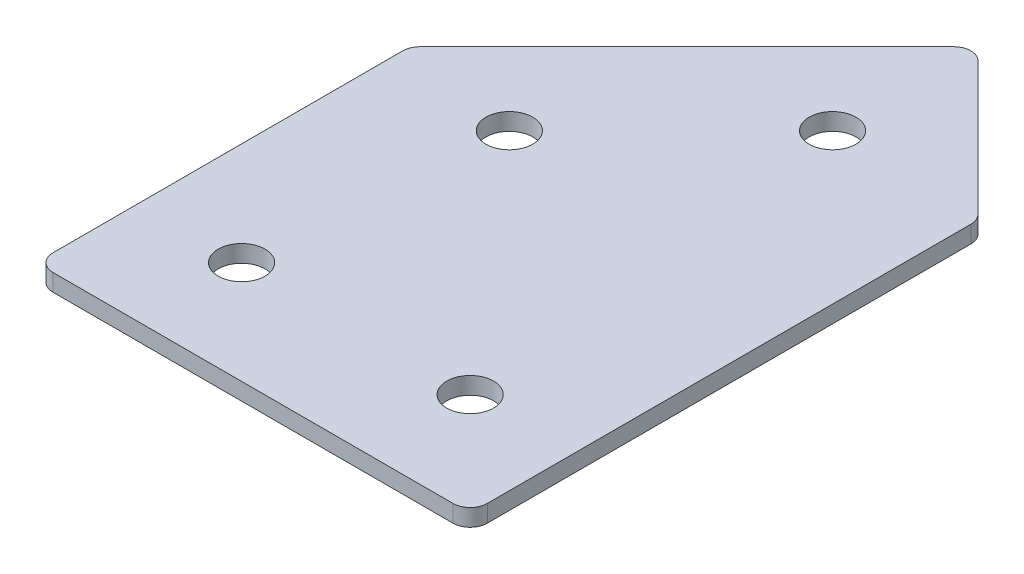
ISO-10303-21;
HEADER;
FILE_DESCRIPTION(('STEP AP214'),'2;1');
FILE_NAME('part.step','',(''),(''),'','','');
FILE_SCHEMA(('AUTOMOTIVE_DESIGN { 1 0 10303 214 1 1 1 1 }'));
ENDSEC;
DATA;
#1=APPLICATION_CONTEXT('core data for automotive mechanical design processes');
#2=APPLICATION_PROTOCOL_DEFINITION('international standard','automotive_design',2000,#1);
#3=PRODUCT_CONTEXT('',#1,'mechanical');
#4=PRODUCT('Part','Part','',(#3));
#5=PRODUCT_RELATED_PRODUCT_CATEGORY('part','',(#4));
#6=PRODUCT_DEFINITION_FORMATION('','',#4);
#7=PRODUCT_DEFINITION_CONTEXT('part definition',#1,'design');
#8=PRODUCT_DEFINITION('design','',#6,#7);
#9=PRODUCT_DEFINITION_SHAPE('','',#8);
#10=(LENGTH_UNIT() NAMED_UNIT(*) SI_UNIT(.MILLI.,.METRE.));
#11=(NAMED_UNIT(*) PLANE_ANGLE_UNIT() SI_UNIT($,.RADIAN.));
#12=(NAMED_UNIT(*) SI_UNIT($,.STERADIAN.) SOLID_ANGLE_UNIT());
#13=UNCERTAINTY_MEASURE_WITH_UNIT(LENGTH_MEASURE(1.E-05),#10,'distance_accuracy_value','');
#14=(GEOMETRIC_REPRESENTATION_CONTEXT(3) GLOBAL_UNCERTAINTY_ASSIGNED_CONTEXT((#13)) GLOBAL_UNIT_ASSIGNED_CONTEXT((#10,
#11,#12)) REPRESENTATION_CONTEXT('',''));
#15=CARTESIAN_POINT('',(0.,0.,0.));
#16=DIRECTION('',(0.,0.,1.));
#17=DIRECTION('',(1.,0.,0.));
#18=AXIS2_PLACEMENT_3D('',#15,#16,#17);
#19=CARTESIAN_POINT('',(-60.9913060903841,-0.0918466072689626,38.5478476375261));
#20=DIRECTION('',(0.,1.,0.));
#21=DIRECTION('',(0.,0.,1.));
#22=AXIS2_PLACEMENT_3D('',#19,#20,#21);
#23=PLANE('',#22);
#24=CARTESIAN_POINT('',(19.0086939096159,-0.0918466072689626,38.5478476375261));
#25=DIRECTION('',(0.,1.,0.));
#26=DIRECTION('',(0.,0.,1.));
#27=AXIS2_PLACEMENT_3D('',#24,#25,#26);
#28=CIRCLE('',#27,4.09999999999999);
#29=CARTESIAN_POINT('',(19.0086939096159,-0.0918466072689626,42.6478476375261));
#30=VERTEX_POINT('',#29);
#31=EDGE_CURVE('E201',#30,#30,#28,.T.);
#32=ORIENTED_EDGE('',*,*,#31,.T.);
#33=EDGE_LOOP('',(#32));
#34=FACE_BOUND('',#33,.T.);
#35=CARTESIAN_POINT('',(10.7244226621539,-0.0918466072689626,-33.1678811150108));
#36=DIRECTION('',(0.,1.,0.));
#37=DIRECTION('',(0.,0.,1.));
#38=AXIS2_PLACEMENT_3D('',#35,#36,#37);
#39=CIRCLE('',#38,4.09999999999998);
#40=CARTESIAN_POINT('',(10.7244226621539,-0.0918466072689626,-29.0678811150108));
#41=VERTEX_POINT('',#40);
#42=EDGE_CURVE('E195',#41,#41,#39,.T.);
#43=ORIENTED_EDGE('',*,*,#42,.T.);
#44=EDGE_LOOP('',(#43));
#45=FACE_BOUND('',#44,.T.);
#46=CARTESIAN_POINT('',(-17.559848585308,-0.0918466072689626,-4.8836098675489));
#47=DIRECTION('',(0.,1.,0.));
#48=DIRECTION('',(0.,0.,1.));
#49=AXIS2_PLACEMENT_3D('',#46,#47,#48);
#50=CIRCLE('',#49,4.1);
#51=CARTESIAN_POINT('',(-17.559848585308,-0.0918466072689626,-0.783609867548904));
#52=VERTEX_POINT('',#51);
#53=EDGE_CURVE('E189',#52,#52,#50,.T.);
#54=ORIENTED_EDGE('',*,*,#53,.T.);
#55=EDGE_LOOP('',(#54));
#56=FACE_BOUND('',#55,.T.);
#57=CARTESIAN_POINT('',(-20.9913060903841,-0.0918466072689626,38.5478476375261));
#58=DIRECTION('',(0.,1.,0.));
#59=DIRECTION('',(0.,0.,1.));
#60=AXIS2_PLACEMENT_3D('',#57,#58,#59);
#61=CIRCLE('',#60,4.1);
#62=CARTESIAN_POINT('',(-20.9913060903841,-0.0918466072689626,42.6478476375261));
#63=VERTEX_POINT('',#62);
#64=EDGE_CURVE('E115',#63,#63,#61,.T.);
#65=ORIENTED_EDGE('',*,*,#64,.T.);
#66=EDGE_LOOP('',(#65));
#67=FACE_BOUND('',#66,.T.);
#68=DIRECTION('',(0.,0.,1.));
#69=VECTOR('',#68,1.);
#70=CARTESIAN_POINT('',(-38.9913060903841,-0.0918466072689626,-8.90799648518868));
#71=LINE('',#70,#69);
#72=CARTESIAN_POINT('',(-38.9913060903841,-0.0918466072689626,-7.66535579806939));
#73=VERTEX_POINT('',#72);
#74=CARTESIAN_POINT('',(-38.9913060903841,-0.0918466072689626,53.547847637526));
#75=VERTEX_POINT('',#74);
#76=EDGE_CURVE('E182',#73,#75,#71,.T.);
#77=ORIENTED_EDGE('',*,*,#76,.F.);
#78=CARTESIAN_POINT('',(-35.9913060903841,-0.0918466072689626,-7.66535579806939));
#79=DIRECTION('',(0.,1.,0.));
#80=DIRECTION('',(0.,0.,1.));
#81=AXIS2_PLACEMENT_3D('',#78,#79,#80);
#82=CIRCLE('',#81,3.);
#83=CARTESIAN_POINT('',(-38.1126264339437,-0.0918466072689626,-9.78667614162903));
#84=VERTEX_POINT('',#83);
#85=EDGE_CURVE('E146',#73,#84,#82,.F.);
#86=ORIENTED_EDGE('',*,*,#85,.T.);
#87=DIRECTION('',(-0.707106781186548,0.,0.707106781186547));
#88=VECTOR('',#87,1.);
#89=CARTESIAN_POINT('',(10.7244226621539,-0.0918466072689626,-58.6237252377266));
#90=LINE('',#89,#88);
#91=CARTESIAN_POINT('',(8.60310231859426,-0.0918466072689626,-56.5024048941669));
#92=VERTEX_POINT('',#91);
#93=EDGE_CURVE('E174',#92,#84,#90,.T.);
#94=ORIENTED_EDGE('',*,*,#93,.F.);
#95=CARTESIAN_POINT('',(10.7244226621539,-0.0918466072689626,-54.3810845506073));
#96=DIRECTION('',(0.,1.,0.));
#97=DIRECTION('',(0.,0.,1.));
#98=AXIS2_PLACEMENT_3D('',#95,#96,#97);
#99=CIRCLE('',#98,3.);
#100=CARTESIAN_POINT('',(12.8457430057135,-0.0918466072689626,-56.5024048941669));
#101=VERTEX_POINT('',#100);
#102=EDGE_CURVE('E118',#92,#101,#99,.F.);
#103=ORIENTED_EDGE('',*,*,#102,.T.);
#104=DIRECTION('',(-0.707106781186548,0.,-0.707106781186547));
#105=VECTOR('',#104,1.);
#106=CARTESIAN_POINT('',(37.0086939096159,-0.0918466072689626,-32.3394539902646));
#107=LINE('',#106,#105);
#108=CARTESIAN_POINT('',(36.1300142531755,-0.0918466072689626,-33.218133646705));
#109=VERTEX_POINT('',#108);
#110=EDGE_CURVE('E119',#109,#101,#107,.T.);
#111=ORIENTED_EDGE('',*,*,#110,.F.);
#112=CARTESIAN_POINT('',(34.0086939096159,-0.0918466072689626,-31.0968133031453));
#113=DIRECTION('',(0.,1.,0.));
#114=DIRECTION('',(0.,0.,1.));
#115=AXIS2_PLACEMENT_3D('',#112,#113,#114);
#116=CIRCLE('',#115,3.);
#117=CARTESIAN_POINT('',(37.0086939096159,-0.0918466072689626,-31.0968133031453));
#118=VERTEX_POINT('',#117);
#119=EDGE_CURVE('E141',#109,#118,#116,.F.);
#120=ORIENTED_EDGE('',*,*,#119,.T.);
#121=DIRECTION('',(0.,0.,-1.));
#122=VECTOR('',#121,1.);
#123=CARTESIAN_POINT('',(37.0086939096159,-0.0918466072689626,56.547847637526));
#124=LINE('',#123,#122);
#125=CARTESIAN_POINT('',(37.0086939096159,-0.0918466072689626,53.547847637526));
#126=VERTEX_POINT('',#125);
#127=EDGE_CURVE('E123',#126,#118,#124,.T.);
#128=ORIENTED_EDGE('',*,*,#127,.F.);
#129=CARTESIAN_POINT('',(34.0086939096159,-0.0918466072689626,53.547847637526));
#130=DIRECTION('',(0.,1.,0.));
#131=DIRECTION('',(0.,0.,1.));
#132=AXIS2_PLACEMENT_3D('',#129,#130,#131);
#133=CIRCLE('',#132,3.);
#134=CARTESIAN_POINT('',(34.0086939096158,-0.0918466072689626,56.547847637526));
#135=VERTEX_POINT('',#134);
#136=EDGE_CURVE('E31',#126,#135,#133,.F.);
#137=ORIENTED_EDGE('',*,*,#136,.T.);
#138=DIRECTION('',(1.,0.,0.));
#139=VECTOR('',#138,1.);
#140=CARTESIAN_POINT('',(-38.9913060903841,-0.0918466072689626,56.547847637526));
#141=LINE('',#140,#139);
#142=CARTESIAN_POINT('',(-35.9913060903841,-0.0918466072689626,56.547847637526));
#143=VERTEX_POINT('',#142);
#144=EDGE_CURVE('E180',#143,#135,#141,.T.);
#145=ORIENTED_EDGE('',*,*,#144,.F.);
#146=CARTESIAN_POINT('',(-35.9913060903841,-0.0918466072689626,53.547847637526));
#147=DIRECTION('',(0.,1.,0.));
#148=DIRECTION('',(0.,0.,1.));
#149=AXIS2_PLACEMENT_3D('',#146,#147,#148);
#150=CIRCLE('',#149,3.);
#151=EDGE_CURVE('E144',#143,#75,#150,.F.);
#152=ORIENTED_EDGE('',*,*,#151,.T.);
#153=EDGE_LOOP('',(#77,#86,#94,#103,#111,#120,#128,#137,#145,#152));
#154=FACE_BOUND('',#153,.T.);
#155=ADVANCED_FACE('F16',(#34,#45,#56,#67,#154),#23,.F.);
#156=CARTESIAN_POINT('',(10.7244226621539,-0.0918466072689626,-58.6237252377266));
#157=DIRECTION('',(-0.707106781186547,0.,-0.707106781186548));
#158=DIRECTION('',(-0.707106781186548,0.,0.707106781186547));
#159=AXIS2_PLACEMENT_3D('',#156,#157,#158);
#160=PLANE('',#159);
#161=ORIENTED_EDGE('',*,*,#93,.T.);
#162=DIRECTION('',(0.,1.,0.));
#163=VECTOR('',#162,1.);
#164=CARTESIAN_POINT('',(-38.1126264339437,-0.0918466072689626,-9.78667614162904));
#165=LINE('',#164,#163);
#166=CARTESIAN_POINT('',(-38.1126264339437,2.90815339273104,-9.78667614162903));
#167=VERTEX_POINT('',#166);
#168=EDGE_CURVE('E105',#84,#167,#165,.T.);
#169=ORIENTED_EDGE('',*,*,#168,.T.);
#170=DIRECTION('',(-0.707106781186548,0.,0.707106781186547));
#171=VECTOR('',#170,1.);
#172=CARTESIAN_POINT('',(10.7244226621539,2.90815339273104,-58.6237252377266));
#173=LINE('',#172,#171);
#174=CARTESIAN_POINT('',(8.60310231859426,2.90815339273104,-56.5024048941669));
#175=VERTEX_POINT('',#174);
#176=EDGE_CURVE('E97',#175,#167,#173,.T.);
#177=ORIENTED_EDGE('',*,*,#176,.F.);
#178=DIRECTION('',(0.,1.,0.));
#179=VECTOR('',#178,1.);
#180=CARTESIAN_POINT('',(8.60310231859426,-0.0918466072689626,-56.5024048941669));
#181=LINE('',#180,#179);
#182=EDGE_CURVE('E111',#175,#92,#181,.F.);
#183=ORIENTED_EDGE('',*,*,#182,.T.);
#184=EDGE_LOOP('',(#161,#169,#177,#183));
#185=FACE_BOUND('',#184,.T.);
#186=ADVANCED_FACE('F110',(#185),#160,.T.);
#187=CARTESIAN_POINT('',(37.0086939096159,-0.0918466072689626,-32.3394539902646));
#188=DIRECTION('',(0.707106781186547,0.,-0.707106781186548));
#189=DIRECTION('',(-0.707106781186548,0.,-0.707106781186547));
#190=AXIS2_PLACEMENT_3D('',#187,#188,#189);
#191=PLANE('',#190);
#192=DIRECTION('',(-0.707106781186548,0.,-0.707106781186547));
#193=VECTOR('',#192,1.);
#194=CARTESIAN_POINT('',(37.0086939096159,2.90815339273104,-32.3394539902646));
#195=LINE('',#194,#193);
#196=CARTESIAN_POINT('',(36.1300142531755,2.90815339273104,-33.218133646705));
#197=VERTEX_POINT('',#196);
#198=CARTESIAN_POINT('',(12.8457430057135,2.90815339273104,-56.5024048941669));
#199=VERTEX_POINT('',#198);
#200=EDGE_CURVE('E99',#197,#199,#195,.T.);
#201=ORIENTED_EDGE('',*,*,#200,.F.);
#202=DIRECTION('',(0.,1.,0.));
#203=VECTOR('',#202,1.);
#204=CARTESIAN_POINT('',(36.1300142531755,-0.0918466072689626,-33.218133646705));
#205=LINE('',#204,#203);
#206=EDGE_CURVE('E10',#197,#109,#205,.F.);
#207=ORIENTED_EDGE('',*,*,#206,.T.);
#208=ORIENTED_EDGE('',*,*,#110,.T.);
#209=DIRECTION('',(0.,1.,0.));
#210=VECTOR('',#209,1.);
#211=CARTESIAN_POINT('',(12.8457430057135,-0.0918466072689626,-56.5024048941669));
#212=LINE('',#211,#210);
#213=EDGE_CURVE('E24',#101,#199,#212,.T.);
#214=ORIENTED_EDGE('',*,*,#213,.T.);
#215=EDGE_LOOP('',(#201,#207,#208,#214));
#216=FACE_BOUND('',#215,.T.);
#217=ADVANCED_FACE('F157',(#216),#191,.T.);
#218=CARTESIAN_POINT('',(37.0086939096159,-0.0918466072689626,56.547847637526));
#219=DIRECTION('',(1.,0.,0.));
#220=DIRECTION('',(0.,0.,-1.));
#221=AXIS2_PLACEMENT_3D('',#218,#219,#220);
#222=PLANE('',#221);
#223=DIRECTION('',(0.,0.,-1.));
#224=VECTOR('',#223,1.);
#225=CARTESIAN_POINT('',(37.0086939096159,2.90815339273104,56.547847637526));
#226=LINE('',#225,#224);
#227=CARTESIAN_POINT('',(37.0086939096159,2.90815339273104,53.547847637526));
#228=VERTEX_POINT('',#227);
#229=CARTESIAN_POINT('',(37.0086939096159,2.90815339273104,-31.0968133031453));
#230=VERTEX_POINT('',#229);
#231=EDGE_CURVE('E170',#228,#230,#226,.T.);
#232=ORIENTED_EDGE('',*,*,#231,.F.);
#233=DIRECTION('',(0.,1.,0.));
#234=VECTOR('',#233,1.);
#235=CARTESIAN_POINT('',(37.0086939096159,-0.0918466072689626,53.547847637526));
#236=LINE('',#235,#234);
#237=EDGE_CURVE('E155',#228,#126,#236,.F.);
#238=ORIENTED_EDGE('',*,*,#237,.T.);
#239=ORIENTED_EDGE('',*,*,#127,.T.);
#240=DIRECTION('',(0.,1.,0.));
#241=VECTOR('',#240,1.);
#242=CARTESIAN_POINT('',(37.0086939096159,-0.0918466072689626,-31.0968133031453));
#243=LINE('',#242,#241);
#244=EDGE_CURVE('E152',#118,#230,#243,.T.);
#245=ORIENTED_EDGE('',*,*,#244,.T.);
#246=EDGE_LOOP('',(#232,#238,#239,#245));
#247=FACE_BOUND('',#246,.T.);
#248=ADVANCED_FACE('F169',(#247),#222,.T.);
#249=CARTESIAN_POINT('',(-38.9913060903841,-0.0918466072689626,56.547847637526));
#250=DIRECTION('',(0.,0.,1.));
#251=DIRECTION('',(1.,0.,0.));
#252=AXIS2_PLACEMENT_3D('',#249,#250,#251);
#253=PLANE('',#252);
#254=DIRECTION('',(1.,0.,0.));
#255=VECTOR('',#254,1.);
#256=CARTESIAN_POINT('',(-38.9913060903841,2.90815339273104,56.547847637526));
#257=LINE('',#256,#255);
#258=CARTESIAN_POINT('',(-35.9913060903841,2.90815339273104,56.547847637526));
#259=VERTEX_POINT('',#258);
#260=CARTESIAN_POINT('',(34.0086939096158,2.90815339273104,56.547847637526));
#261=VERTEX_POINT('',#260);
#262=EDGE_CURVE('E173',#259,#261,#257,.T.);
#263=ORIENTED_EDGE('',*,*,#262,.F.);
#264=DIRECTION('',(0.,1.,0.));
#265=VECTOR('',#264,1.);
#266=CARTESIAN_POINT('',(-35.9913060903841,-0.0918466072689626,56.547847637526));
#267=LINE('',#266,#265);
#268=EDGE_CURVE('E38',#259,#143,#267,.F.);
#269=ORIENTED_EDGE('',*,*,#268,.T.);
#270=ORIENTED_EDGE('',*,*,#144,.T.);
#271=DIRECTION('',(0.,1.,0.));
#272=VECTOR('',#271,1.);
#273=CARTESIAN_POINT('',(34.0086939096159,-0.0918466072689626,56.547847637526));
#274=LINE('',#273,#272);
#275=EDGE_CURVE('E148',#135,#261,#274,.T.);
#276=ORIENTED_EDGE('',*,*,#275,.T.);
#277=EDGE_LOOP('',(#263,#269,#270,#276));
#278=FACE_BOUND('',#277,.T.);
#279=ADVANCED_FACE('F333',(#278),#253,.T.);
#280=CARTESIAN_POINT('',(-38.9913060903841,-0.0918466072689626,-8.90799648518868));
#281=DIRECTION('',(-1.,0.,0.));
#282=DIRECTION('',(0.,0.,1.));
#283=AXIS2_PLACEMENT_3D('',#280,#281,#282);
#284=PLANE('',#283);
#285=DIRECTION('',(0.,0.,1.));
#286=VECTOR('',#285,1.);
#287=CARTESIAN_POINT('',(-38.9913060903841,2.90815339273104,-8.90799648518868));
#288=LINE('',#287,#286);
#289=CARTESIAN_POINT('',(-38.9913060903841,2.90815339273104,-7.66535579806939));
#290=VERTEX_POINT('',#289);
#291=CARTESIAN_POINT('',(-38.9913060903841,2.90815339273104,53.547847637526));
#292=VERTEX_POINT('',#291);
#293=EDGE_CURVE('E114',#290,#292,#288,.T.);
#294=ORIENTED_EDGE('',*,*,#293,.F.);
#295=DIRECTION('',(0.,1.,0.));
#296=VECTOR('',#295,1.);
#297=CARTESIAN_POINT('',(-38.9913060903841,-0.0918466072689626,-7.66535579806939));
#298=LINE('',#297,#296);
#299=EDGE_CURVE('E138',#290,#73,#298,.F.);
#300=ORIENTED_EDGE('',*,*,#299,.T.);
#301=ORIENTED_EDGE('',*,*,#76,.T.);
#302=DIRECTION('',(0.,1.,0.));
#303=VECTOR('',#302,1.);
#304=CARTESIAN_POINT('',(-38.9913060903841,-0.0918466072689626,53.547847637526));
#305=LINE('',#304,#303);
#306=EDGE_CURVE('E135',#75,#292,#305,.T.);
#307=ORIENTED_EDGE('',*,*,#306,.T.);
#308=EDGE_LOOP('',(#294,#300,#301,#307));
#309=FACE_BOUND('',#308,.T.);
#310=ADVANCED_FACE('F223',(#309),#284,.T.);
#311=CARTESIAN_POINT('',(-60.9913060903841,2.90815339273104,38.5478476375261));
#312=DIRECTION('',(0.,1.,0.));
#313=DIRECTION('',(0.,0.,1.));
#314=AXIS2_PLACEMENT_3D('',#311,#312,#313);
#315=PLANE('',#314);
#316=CARTESIAN_POINT('',(19.0086939096159,2.90815339273104,38.5478476375261));
#317=DIRECTION('',(0.,1.,0.));
#318=DIRECTION('',(0.,0.,1.));
#319=AXIS2_PLACEMENT_3D('',#316,#317,#318);
#320=CIRCLE('',#319,4.09999999999999);
#321=CARTESIAN_POINT('',(19.0086939096159,2.90815339273104,42.6478476375261));
#322=VERTEX_POINT('',#321);
#323=EDGE_CURVE('E204',#322,#322,#320,.T.);
#324=ORIENTED_EDGE('',*,*,#323,.F.);
#325=EDGE_LOOP('',(#324));
#326=FACE_BOUND('',#325,.T.);
#327=CARTESIAN_POINT('',(10.7244226621539,2.90815339273104,-33.1678811150108));
#328=DIRECTION('',(0.,1.,0.));
#329=DIRECTION('',(0.,0.,1.));
#330=AXIS2_PLACEMENT_3D('',#327,#328,#329);
#331=CIRCLE('',#330,4.09999999999998);
#332=CARTESIAN_POINT('',(10.7244226621539,2.90815339273104,-29.0678811150108));
#333=VERTEX_POINT('',#332);
#334=EDGE_CURVE('E198',#333,#333,#331,.T.);
#335=ORIENTED_EDGE('',*,*,#334,.F.);
#336=EDGE_LOOP('',(#335));
#337=FACE_BOUND('',#336,.T.);
#338=CARTESIAN_POINT('',(-17.559848585308,2.90815339273104,-4.8836098675489));
#339=DIRECTION('',(0.,1.,0.));
#340=DIRECTION('',(0.,0.,1.));
#341=AXIS2_PLACEMENT_3D('',#338,#339,#340);
#342=CIRCLE('',#341,4.1);
#343=CARTESIAN_POINT('',(-17.559848585308,2.90815339273104,-0.783609867548904));
#344=VERTEX_POINT('',#343);
#345=EDGE_CURVE('E192',#344,#344,#342,.T.);
#346=ORIENTED_EDGE('',*,*,#345,.F.);
#347=EDGE_LOOP('',(#346));
#348=FACE_BOUND('',#347,.T.);
#349=CARTESIAN_POINT('',(-20.9913060903841,2.90815339273104,38.5478476375261));
#350=DIRECTION('',(0.,1.,0.));
#351=DIRECTION('',(0.,0.,1.));
#352=AXIS2_PLACEMENT_3D('',#349,#350,#351);
#353=CIRCLE('',#352,4.1);
#354=CARTESIAN_POINT('',(-20.9913060903841,2.90815339273104,42.6478476375261));
#355=VERTEX_POINT('',#354);
#356=EDGE_CURVE('E186',#355,#355,#353,.T.);
#357=ORIENTED_EDGE('',*,*,#356,.F.);
#358=EDGE_LOOP('',(#357));
#359=FACE_BOUND('',#358,.T.);
#360=ORIENTED_EDGE('',*,*,#176,.T.);
#361=CARTESIAN_POINT('',(-35.9913060903841,2.90815339273104,-7.66535579806939));
#362=DIRECTION('',(0.,1.,0.));
#363=DIRECTION('',(0.,0.,1.));
#364=AXIS2_PLACEMENT_3D('',#361,#362,#363);
#365=CIRCLE('',#364,3.);
#366=EDGE_CURVE('E133',#167,#290,#365,.T.);
#367=ORIENTED_EDGE('',*,*,#366,.T.);
#368=ORIENTED_EDGE('',*,*,#293,.T.);
#369=CARTESIAN_POINT('',(-35.9913060903841,2.90815339273104,53.547847637526));
#370=DIRECTION('',(0.,1.,0.));
#371=DIRECTION('',(0.,0.,1.));
#372=AXIS2_PLACEMENT_3D('',#369,#370,#371);
#373=CIRCLE('',#372,3.);
#374=EDGE_CURVE('E131',#292,#259,#373,.T.);
#375=ORIENTED_EDGE('',*,*,#374,.T.);
#376=ORIENTED_EDGE('',*,*,#262,.T.);
#377=CARTESIAN_POINT('',(34.0086939096159,2.90815339273104,53.547847637526));
#378=DIRECTION('',(0.,1.,0.));
#379=DIRECTION('',(0.,0.,1.));
#380=AXIS2_PLACEMENT_3D('',#377,#378,#379);
#381=CIRCLE('',#380,3.);
#382=EDGE_CURVE('E129',#261,#228,#381,.T.);
#383=ORIENTED_EDGE('',*,*,#382,.T.);
#384=ORIENTED_EDGE('',*,*,#231,.T.);
#385=CARTESIAN_POINT('',(34.0086939096159,2.90815339273104,-31.0968133031453));
#386=DIRECTION('',(0.,1.,0.));
#387=DIRECTION('',(0.,0.,1.));
#388=AXIS2_PLACEMENT_3D('',#385,#386,#387);
#389=CIRCLE('',#388,3.);
#390=EDGE_CURVE('E104',#230,#197,#389,.T.);
#391=ORIENTED_EDGE('',*,*,#390,.T.);
#392=ORIENTED_EDGE('',*,*,#200,.T.);
#393=CARTESIAN_POINT('',(10.7244226621539,2.90815339273104,-54.3810845506073));
#394=DIRECTION('',(0.,1.,0.));
#395=DIRECTION('',(0.,0.,1.));
#396=AXIS2_PLACEMENT_3D('',#393,#394,#395);
#397=CIRCLE('',#396,3.);
#398=EDGE_CURVE('E94',#199,#175,#397,.T.);
#399=ORIENTED_EDGE('',*,*,#398,.T.);
#400=EDGE_LOOP('',(#360,#367,#368,#375,#376,#383,#384,#391,#392,#399));
#401=FACE_BOUND('',#400,.T.);
#402=ADVANCED_FACE('F96',(#326,#337,#348,#359,#401),#315,.T.);
#403=CARTESIAN_POINT('',(-20.9913060903841,-0.0918466072689626,38.5478476375261));
#404=DIRECTION('',(0.,1.,0.));
#405=DIRECTION('',(0.,0.,1.));
#406=AXIS2_PLACEMENT_3D('',#403,#404,#405);
#407=CYLINDRICAL_SURFACE('',#406,4.1);
#408=ORIENTED_EDGE('',*,*,#64,.F.);
#409=EDGE_LOOP('',(#408));
#410=FACE_BOUND('',#409,.T.);
#411=ORIENTED_EDGE('',*,*,#356,.T.);
#412=EDGE_LOOP('',(#411));
#413=FACE_BOUND('',#412,.T.);
#414=ADVANCED_FACE('F222',(#410,#413),#407,.F.);
#415=CARTESIAN_POINT('',(-17.559848585308,-0.0918466072689626,-4.8836098675489));
#416=DIRECTION('',(0.,1.,0.));
#417=DIRECTION('',(0.,0.,1.));
#418=AXIS2_PLACEMENT_3D('',#415,#416,#417);
#419=CYLINDRICAL_SURFACE('',#418,4.1);
#420=ORIENTED_EDGE('',*,*,#53,.F.);
#421=EDGE_LOOP('',(#420));
#422=FACE_BOUND('',#421,.T.);
#423=ORIENTED_EDGE('',*,*,#345,.T.);
#424=EDGE_LOOP('',(#423));
#425=FACE_BOUND('',#424,.T.);
#426=ADVANCED_FACE('F232',(#422,#425),#419,.F.);
#427=CARTESIAN_POINT('',(10.7244226621539,-0.0918466072689626,-33.1678811150108));
#428=DIRECTION('',(0.,1.,0.));
#429=DIRECTION('',(0.,0.,1.));
#430=AXIS2_PLACEMENT_3D('',#427,#428,#429);
#431=CYLINDRICAL_SURFACE('',#430,4.09999999999998);
#432=ORIENTED_EDGE('',*,*,#42,.F.);
#433=EDGE_LOOP('',(#432));
#434=FACE_BOUND('',#433,.T.);
#435=ORIENTED_EDGE('',*,*,#334,.T.);
#436=EDGE_LOOP('',(#435));
#437=FACE_BOUND('',#436,.T.);
#438=ADVANCED_FACE('F216',(#434,#437),#431,.F.);
#439=CARTESIAN_POINT('',(19.0086939096159,-0.0918466072689626,38.5478476375261));
#440=DIRECTION('',(0.,1.,0.));
#441=DIRECTION('',(0.,0.,1.));
#442=AXIS2_PLACEMENT_3D('',#439,#440,#441);
#443=CYLINDRICAL_SURFACE('',#442,4.09999999999999);
#444=ORIENTED_EDGE('',*,*,#31,.F.);
#445=EDGE_LOOP('',(#444));
#446=FACE_BOUND('',#445,.T.);
#447=ORIENTED_EDGE('',*,*,#323,.T.);
#448=EDGE_LOOP('',(#447));
#449=FACE_BOUND('',#448,.T.);
#450=ADVANCED_FACE('F212',(#446,#449),#443,.F.);
#451=CARTESIAN_POINT('',(-35.9913060903841,-0.0918466072689626,-7.66535579806939));
#452=DIRECTION('',(0.,1.,0.));
#453=DIRECTION('',(0.,0.,1.));
#454=AXIS2_PLACEMENT_3D('',#451,#452,#453);
#455=CYLINDRICAL_SURFACE('',#454,3.);
#456=ORIENTED_EDGE('',*,*,#85,.F.);
#457=ORIENTED_EDGE('',*,*,#299,.F.);
#458=ORIENTED_EDGE('',*,*,#366,.F.);
#459=ORIENTED_EDGE('',*,*,#168,.F.);
#460=EDGE_LOOP('',(#456,#457,#458,#459));
#461=FACE_BOUND('',#460,.T.);
#462=ADVANCED_FACE('F215',(#461),#455,.T.);
#463=CARTESIAN_POINT('',(-35.9913060903841,-0.0918466072689626,53.547847637526));
#464=DIRECTION('',(0.,1.,0.));
#465=DIRECTION('',(0.,0.,1.));
#466=AXIS2_PLACEMENT_3D('',#463,#464,#465);
#467=CYLINDRICAL_SURFACE('',#466,3.);
#468=ORIENTED_EDGE('',*,*,#151,.F.);
#469=ORIENTED_EDGE('',*,*,#268,.F.);
#470=ORIENTED_EDGE('',*,*,#374,.F.);
#471=ORIENTED_EDGE('',*,*,#306,.F.);
#472=EDGE_LOOP('',(#468,#469,#470,#471));
#473=FACE_BOUND('',#472,.T.);
#474=ADVANCED_FACE('F252',(#473),#467,.T.);
#475=CARTESIAN_POINT('',(34.0086939096159,-0.0918466072689626,53.547847637526));
#476=DIRECTION('',(0.,1.,0.));
#477=DIRECTION('',(0.,0.,1.));
#478=AXIS2_PLACEMENT_3D('',#475,#476,#477);
#479=CYLINDRICAL_SURFACE('',#478,3.);
#480=ORIENTED_EDGE('',*,*,#136,.F.);
#481=ORIENTED_EDGE('',*,*,#237,.F.);
#482=ORIENTED_EDGE('',*,*,#382,.F.);
#483=ORIENTED_EDGE('',*,*,#275,.F.);
#484=EDGE_LOOP('',(#480,#481,#482,#483));
#485=FACE_BOUND('',#484,.T.);
#486=ADVANCED_FACE('F256',(#485),#479,.T.);
#487=CARTESIAN_POINT('',(34.0086939096159,-0.0918466072689626,-31.0968133031453));
#488=DIRECTION('',(0.,1.,0.));
#489=DIRECTION('',(0.,0.,1.));
#490=AXIS2_PLACEMENT_3D('',#487,#488,#489);
#491=CYLINDRICAL_SURFACE('',#490,3.);
#492=ORIENTED_EDGE('',*,*,#119,.F.);
#493=ORIENTED_EDGE('',*,*,#206,.F.);
#494=ORIENTED_EDGE('',*,*,#390,.F.);
#495=ORIENTED_EDGE('',*,*,#244,.F.);
#496=EDGE_LOOP('',(#492,#493,#494,#495));
#497=FACE_BOUND('',#496,.T.);
#498=ADVANCED_FACE('F165',(#497),#491,.T.);
#499=CARTESIAN_POINT('',(10.7244226621539,-0.0918466072689626,-54.3810845506073));
#500=DIRECTION('',(0.,1.,0.));
#501=DIRECTION('',(0.,0.,1.));
#502=AXIS2_PLACEMENT_3D('',#499,#500,#501);
#503=CYLINDRICAL_SURFACE('',#502,3.);
#504=ORIENTED_EDGE('',*,*,#102,.F.);
#505=ORIENTED_EDGE('',*,*,#182,.F.);
#506=ORIENTED_EDGE('',*,*,#398,.F.);
#507=ORIENTED_EDGE('',*,*,#213,.F.);
#508=EDGE_LOOP('',(#504,#505,#506,#507));
#509=FACE_BOUND('',#508,.T.);
#510=ADVANCED_FACE('F18',(#509),#503,.T.);
#511=CLOSED_SHELL('',(#155,#186,#217,#248,#279,#310,#402,#414,#426,#438,#450,#462,#474,#486,
#498,#510));
#512=MANIFOLD_SOLID_BREP('B1',#511);
#513=ADVANCED_BREP_SHAPE_REPRESENTATION('',(#18,#512),#14);
#514=SHAPE_DEFINITION_REPRESENTATION(#9,#513);
ENDSEC;
END-ISO-10303-21;
